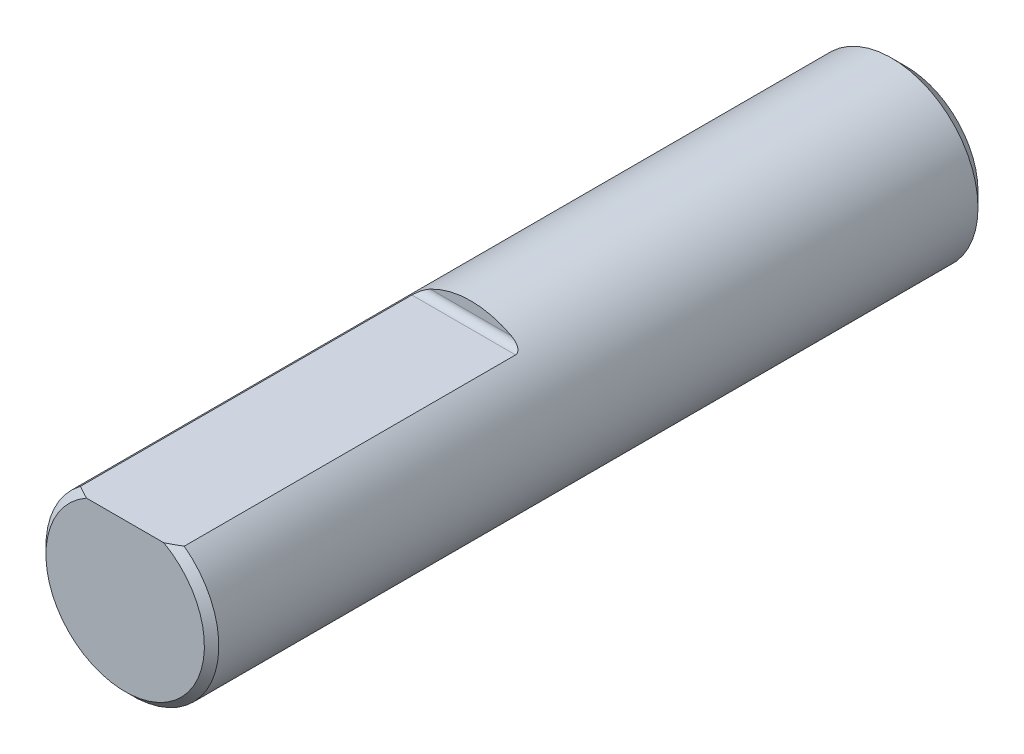
ISO-10303-21;
HEADER;
FILE_DESCRIPTION(('STEP AP214'),'2;1');
FILE_NAME('part.step','',(''),(''),'','','');
FILE_SCHEMA(('AUTOMOTIVE_DESIGN { 1 0 10303 214 1 1 1 1 }'));
ENDSEC;
DATA;
#1=APPLICATION_CONTEXT('core data for automotive mechanical design processes');
#2=APPLICATION_PROTOCOL_DEFINITION('international standard','automotive_design',2000,#1);
#3=PRODUCT_CONTEXT('',#1,'mechanical');
#4=PRODUCT('Part','Part','',(#3));
#5=PRODUCT_RELATED_PRODUCT_CATEGORY('part','',(#4));
#6=PRODUCT_DEFINITION_FORMATION('','',#4);
#7=PRODUCT_DEFINITION_CONTEXT('part definition',#1,'design');
#8=PRODUCT_DEFINITION('design','',#6,#7);
#9=PRODUCT_DEFINITION_SHAPE('','',#8);
#10=(LENGTH_UNIT() NAMED_UNIT(*) SI_UNIT(.MILLI.,.METRE.));
#11=(NAMED_UNIT(*) PLANE_ANGLE_UNIT() SI_UNIT($,.RADIAN.));
#12=(NAMED_UNIT(*) SI_UNIT($,.STERADIAN.) SOLID_ANGLE_UNIT());
#13=UNCERTAINTY_MEASURE_WITH_UNIT(LENGTH_MEASURE(1.E-05),#10,'distance_accuracy_value','');
#14=(GEOMETRIC_REPRESENTATION_CONTEXT(3) GLOBAL_UNCERTAINTY_ASSIGNED_CONTEXT((#13)) GLOBAL_UNIT_ASSIGNED_CONTEXT((#10,
#11,#12)) REPRESENTATION_CONTEXT('',''));
#15=CARTESIAN_POINT('',(0.,0.,0.));
#16=DIRECTION('',(0.,0.,1.));
#17=DIRECTION('',(1.,0.,0.));
#18=AXIS2_PLACEMENT_3D('',#15,#16,#17);
#19=CARTESIAN_POINT('',(0.,0.,27.1));
#20=DIRECTION('',(0.,0.,-1.));
#21=DIRECTION('',(-1.,0.,0.));
#22=AXIS2_PLACEMENT_3D('',#19,#20,#21);
#23=CYLINDRICAL_SURFACE('',#22,3.);
#24=CARTESIAN_POINT('',(0.,0.,0.500000000000021));
#25=DIRECTION('',(0.,0.,1.));
#26=DIRECTION('',(1.,0.,0.));
#27=AXIS2_PLACEMENT_3D('',#24,#25,#26);
#28=CIRCLE('',#27,3.);
#29=CARTESIAN_POINT('',(3.,0.,0.500000000000021));
#30=VERTEX_POINT('',#29);
#31=EDGE_CURVE('E179',#30,#30,#28,.T.);
#32=ORIENTED_EDGE('',*,*,#31,.T.);
#33=EDGE_LOOP('',(#32));
#34=FACE_BOUND('',#33,.T.);
#35=CARTESIAN_POINT('',(0.,0.,15.1));
#36=DIRECTION('',(0.,0.,1.));
#37=DIRECTION('',(1.,0.,0.));
#38=AXIS2_PLACEMENT_3D('',#35,#36,#37);
#39=CIRCLE('',#38,3.);
#40=CARTESIAN_POINT('',(1.40623611104252,2.65,15.1));
#41=VERTEX_POINT('',#40);
#42=CARTESIAN_POINT('',(-1.40623611104252,2.65,15.1));
#43=VERTEX_POINT('',#42);
#44=EDGE_CURVE('E120',#41,#43,#39,.T.);
#45=ORIENTED_EDGE('',*,*,#44,.F.);
#46=CARTESIAN_POINT('',(1.40623611104252,2.65,15.1));
#47=CARTESIAN_POINT('',(1.42476719312358,2.64016820918073,15.1000086371319));
#48=CARTESIAN_POINT('',(1.44320541755287,2.63013300387646,15.1005812001906));
#49=CARTESIAN_POINT('',(1.47987326357008,2.609677203619,15.1030548188532));
#50=CARTESIAN_POINT('',(1.49810172472944,2.59925520129951,15.1049612940171));
#51=CARTESIAN_POINT('',(1.5343315751367,2.57803639991808,15.110329872664));
#52=CARTESIAN_POINT('',(1.55232959190176,2.567237122853,15.1138054139997));
#53=CARTESIAN_POINT('',(1.587744792987,2.54548552392082,15.1225921781681));
#54=CARTESIAN_POINT('',(1.60516300800453,2.53453352883204,15.1278999291877));
#55=CARTESIAN_POINT('',(1.63485119249192,2.51545006459067,15.1390846196437));
#56=CARTESIAN_POINT('',(1.64730062464286,2.50731204810866,15.1444706479159));
#57=CARTESIAN_POINT('',(1.67158745821928,2.49118591569291,15.1566602982219));
#58=CARTESIAN_POINT('',(1.68342527260069,2.48319770099929,15.1634629477389));
#59=CARTESIAN_POINT('',(1.7063536380022,2.46749911358801,15.178783929621));
#60=CARTESIAN_POINT('',(1.71743676342143,2.45979177514725,15.1873167211089));
#61=CARTESIAN_POINT('',(1.73834080545491,2.44506310531191,15.2063169358666));
#62=CARTESIAN_POINT('',(1.74816416885122,2.43804045064985,15.2167805095582));
#63=CARTESIAN_POINT('',(1.76296100156874,2.4273488297489,15.2359681663318));
#64=CARTESIAN_POINT('',(1.76845651552901,2.42334468487254,15.2440999651992));
#65=CARTESIAN_POINT('',(1.77837742284304,2.41607356683765,15.2613121283322));
#66=CARTESIAN_POINT('',(1.78280270247776,2.412806672019,15.2703925932529));
#67=CARTESIAN_POINT('',(1.79033772979604,2.40722107270283,15.2895122670731));
#68=CARTESIAN_POINT('',(1.79343027877899,2.40491477660354,15.2995620738033));
#69=CARTESIAN_POINT('',(1.79791719542313,2.40156245011977,15.3202177234302));
#70=CARTESIAN_POINT('',(1.79931806471234,2.40051159487049,15.3308212730418));
#71=CARTESIAN_POINT('',(1.79993609107004,2.40004787789945,15.3443119358684));
#72=CARTESIAN_POINT('',(1.80000125917157,2.39999896367675,15.3471567213289));
#73=CARTESIAN_POINT('',(1.8,2.4,15.35));
#74=B_SPLINE_CURVE_WITH_KNOTS('',3,(#46,#47,#48,#49,#50,#51,#52,#53,#54,#55,#56,#57,#58,#59,#60,
#61,#62,#63,#64,#65,#66,#67,#68,#69,#70,#71,#72,#73),.UNSPECIFIED.,.F.,.F.,(4,2,2,2,2,2,2,2,2,2,
2,2,2,4),(0.,0.0629448752516046,0.126146985991397,0.189900955592974,0.253534776403439,
0.300929708760606,0.348292210920324,0.396068177672549,0.443749898608375,0.475451559889888,
0.507156588191373,0.539259331957677,0.571238298604583,0.579771352693865),.UNSPECIFIED.);
#75=CARTESIAN_POINT('',(1.8,2.4,15.35));
#76=VERTEX_POINT('',#75);
#77=EDGE_CURVE('E52',#41,#76,#74,.T.);
#78=ORIENTED_EDGE('',*,*,#77,.T.);
#79=DIRECTION('',(0.,0.,1.));
#80=VECTOR('',#79,1.);
#81=CARTESIAN_POINT('',(1.8,2.4,15.1));
#82=LINE('',#81,#80);
#83=CARTESIAN_POINT('',(1.8,2.4,26.85));
#84=VERTEX_POINT('',#83);
#85=EDGE_CURVE('E126',#76,#84,#82,.T.);
#86=ORIENTED_EDGE('',*,*,#85,.T.);
#87=CARTESIAN_POINT('',(0.,0.,26.85));
#88=DIRECTION('',(0.,0.,1.));
#89=DIRECTION('',(1.,0.,0.));
#90=AXIS2_PLACEMENT_3D('',#87,#88,#89);
#91=CIRCLE('',#90,3.);
#92=CARTESIAN_POINT('',(-1.8,2.4,26.85));
#93=VERTEX_POINT('',#92);
#94=EDGE_CURVE('E181',#84,#93,#91,.F.);
#95=ORIENTED_EDGE('',*,*,#94,.T.);
#96=DIRECTION('',(0.,0.,1.));
#97=VECTOR('',#96,1.);
#98=CARTESIAN_POINT('',(-1.8,2.4,15.1));
#99=LINE('',#98,#97);
#100=CARTESIAN_POINT('',(-1.8,2.4,15.35));
#101=VERTEX_POINT('',#100);
#102=EDGE_CURVE('E123',#101,#93,#99,.T.);
#103=ORIENTED_EDGE('',*,*,#102,.F.);
#104=CARTESIAN_POINT('',(-1.8,2.4,15.35));
#105=CARTESIAN_POINT('',(-1.80002307596757,2.3999805782066,15.3398497762364));
#106=CARTESIAN_POINT('',(-1.79917762268597,2.40061688617292,15.3297358056779));
#107=CARTESIAN_POINT('',(-1.79595829572651,2.40302732127865,15.3100064136077));
#108=CARTESIAN_POINT('',(-1.79360165849544,2.4047886160273,15.3003866749197));
#109=CARTESIAN_POINT('',(-1.7875726833598,2.40927311413033,15.2818678747454));
#110=CARTESIAN_POINT('',(-1.78390570997181,2.41199239485877,15.272966053617));
#111=CARTESIAN_POINT('',(-1.77549784658827,2.41818838106542,15.255949471908));
#112=CARTESIAN_POINT('',(-1.77075379680029,2.42166731394476,15.2478371295));
#113=CARTESIAN_POINT('',(-1.75783211284051,2.43107324956358,15.2286061898585));
#114=CARTESIAN_POINT('',(-1.74912509698599,2.43735345452888,15.2180179864987));
#115=CARTESIAN_POINT('',(-1.73041079319432,2.45067580006142,15.1986445717313));
#116=CARTESIAN_POINT('',(-1.720401237775,2.45771926566297,15.1898625750475));
#117=CARTESIAN_POINT('',(-1.69291719447429,2.47678356115711,15.1688774643669));
#118=CARTESIAN_POINT('',(-1.67469673683116,2.48915658953795,15.157981015766));
#119=CARTESIAN_POINT('',(-1.63679129355607,2.51424696062243,15.139488799886));
#120=CARTESIAN_POINT('',(-1.61709867274992,2.52696584431851,15.1319118722863));
#121=CARTESIAN_POINT('',(-1.58162893424236,2.54927028707975,15.1209400595368));
#122=CARTESIAN_POINT('',(-1.56603616538931,2.55888071698269,15.1169789548098));
#123=CARTESIAN_POINT('',(-1.53445756909974,2.57794112174126,15.1103976350237));
#124=CARTESIAN_POINT('',(-1.51847138971993,2.58739093911798,15.107778669992));
#125=CARTESIAN_POINT('',(-1.48653771156903,2.60586627018725,15.1037481910994));
#126=CARTESIAN_POINT('',(-1.47059570505126,2.61489647961756,15.1023138133363));
#127=CARTESIAN_POINT('',(-1.4385387009133,2.63266838458361,15.1004432278105));
#128=CARTESIAN_POINT('',(-1.42242416370951,2.64141067387946,15.1000048201049));
#129=CARTESIAN_POINT('',(-1.40623611104252,2.65,15.1));
#130=B_SPLINE_CURVE_WITH_KNOTS('',3,(#104,#105,#106,#107,#108,#109,#110,#111,#112,#113,#114,
#115,#116,#117,#118,#119,#120,#121,#122,#123,#124,#125,#126,#127,#128,#129),.UNSPECIFIED.,.F.,
.F.,(4,2,2,2,2,2,2,2,2,2,2,2,4),(0.,0.0303382083179854,0.0603363917658789,0.0902131438331527,
0.120178703859017,0.165158889955237,0.210218452837776,0.283525899859539,0.357244171671546,
0.413407103500159,0.469622249114082,0.524725195147192,0.579706308511011),.UNSPECIFIED.);
#131=EDGE_CURVE('E11',#101,#43,#130,.T.);
#132=ORIENTED_EDGE('',*,*,#131,.T.);
#133=EDGE_LOOP('',(#45,#78,#86,#95,#103,#132));
#134=FACE_BOUND('',#133,.T.);
#135=ADVANCED_FACE('F38',(#34,#134),#23,.T.);
#136=CARTESIAN_POINT('',(0.,0.,27.1));
#137=DIRECTION('',(0.,0.,1.));
#138=DIRECTION('',(1.,0.,0.));
#139=AXIS2_PLACEMENT_3D('',#136,#137,#138);
#140=PLANE('',#139);
#141=DIRECTION('',(1.,0.,0.));
#142=VECTOR('',#141,1.);
#143=CARTESIAN_POINT('',(-1.8,2.4,27.1));
#144=LINE('',#143,#142);
#145=CARTESIAN_POINT('',(-1.34257215820978,2.4,27.1));
#146=VERTEX_POINT('',#145);
#147=CARTESIAN_POINT('',(1.34257215820978,2.4,27.1));
#148=VERTEX_POINT('',#147);
#149=EDGE_CURVE('E118',#146,#148,#144,.T.);
#150=ORIENTED_EDGE('',*,*,#149,.F.);
#151=CARTESIAN_POINT('',(0.,0.,27.1));
#152=DIRECTION('',(0.,0.,1.));
#153=DIRECTION('',(1.,0.,0.));
#154=AXIS2_PLACEMENT_3D('',#151,#152,#153);
#155=CIRCLE('',#154,2.75000000000001);
#156=EDGE_CURVE('E128',#146,#148,#155,.T.);
#157=ORIENTED_EDGE('',*,*,#156,.T.);
#158=EDGE_LOOP('',(#150,#157));
#159=FACE_BOUND('',#158,.T.);
#160=ADVANCED_FACE('F156',(#159),#140,.T.);
#161=CARTESIAN_POINT('',(0.,0.,0.));
#162=DIRECTION('',(0.,0.,1.));
#163=DIRECTION('',(1.,0.,0.));
#164=AXIS2_PLACEMENT_3D('',#161,#162,#163);
#165=PLANE('',#164);
#166=CARTESIAN_POINT('',(0.,0.,0.));
#167=DIRECTION('',(0.,0.,1.));
#168=DIRECTION('',(1.,0.,0.));
#169=AXIS2_PLACEMENT_3D('',#166,#167,#168);
#170=CIRCLE('',#169,2.49999999999998);
#171=CARTESIAN_POINT('',(2.49999999999998,0.,0.));
#172=VERTEX_POINT('',#171);
#173=EDGE_CURVE('E176',#172,#172,#170,.F.);
#174=ORIENTED_EDGE('',*,*,#173,.T.);
#175=EDGE_LOOP('',(#174));
#176=FACE_BOUND('',#175,.T.);
#177=DIRECTION('',(1.,0.,0.));
#178=VECTOR('',#177,1.);
#179=CARTESIAN_POINT('',(0.,0.75,0.));
#180=LINE('',#179,#178);
#181=CARTESIAN_POINT('',(-0.661437827766148,0.75,0.));
#182=VERTEX_POINT('',#181);
#183=CARTESIAN_POINT('',(0.661437827766148,0.75,0.));
#184=VERTEX_POINT('',#183);
#185=EDGE_CURVE('E113',#182,#184,#180,.T.);
#186=ORIENTED_EDGE('',*,*,#185,.F.);
#187=CARTESIAN_POINT('',(0.,0.,0.));
#188=DIRECTION('',(0.,0.,-1.));
#189=DIRECTION('',(-1.,0.,0.));
#190=AXIS2_PLACEMENT_3D('',#187,#188,#189);
#191=CIRCLE('',#190,1.);
#192=EDGE_CURVE('E101',#184,#182,#191,.T.);
#193=ORIENTED_EDGE('',*,*,#192,.F.);
#194=EDGE_LOOP('',(#186,#193));
#195=FACE_BOUND('',#194,.T.);
#196=ADVANCED_FACE('F154',(#176,#195),#165,.F.);
#197=CARTESIAN_POINT('',(-1.8,2.4,15.1));
#198=DIRECTION('',(0.,-1.,0.));
#199=DIRECTION('',(0.,0.,-1.));
#200=AXIS2_PLACEMENT_3D('',#197,#198,#199);
#201=PLANE('',#200);
#202=ORIENTED_EDGE('',*,*,#85,.F.);
#203=DIRECTION('',(1.,0.,0.));
#204=VECTOR('',#203,1.);
#205=CARTESIAN_POINT('',(-1.8,2.4,15.35));
#206=LINE('',#205,#204);
#207=EDGE_CURVE('E59',#76,#101,#206,.F.);
#208=ORIENTED_EDGE('',*,*,#207,.T.);
#209=ORIENTED_EDGE('',*,*,#102,.T.);
#210=CARTESIAN_POINT('',(-1.8,2.4,26.85));
#211=CARTESIAN_POINT('',(-1.76273123698928,2.4,26.8723595436047));
#212=CARTESIAN_POINT('',(-1.72526649526937,2.4,26.8943956211421));
#213=CARTESIAN_POINT('',(-1.64993454455618,2.4,26.9377272457753));
#214=CARTESIAN_POINT('',(-1.6120675295446,2.4,26.9590231303671));
#215=CARTESIAN_POINT('',(-1.53588371404093,2.4,27.0008029147796));
#216=CARTESIAN_POINT('',(-1.49756688517465,2.4,27.0212867630167));
#217=CARTESIAN_POINT('',(-1.42044115771704,2.4,27.0613498939592));
#218=CARTESIAN_POINT('',(-1.38163203974269,2.4,27.0809287539275));
#219=CARTESIAN_POINT('',(-1.34257215820978,2.4,27.1));
#220=B_SPLINE_CURVE_WITH_KNOTS('',3,(#210,#211,#212,#213,#214,#215,#216,#217,#218,#219),
.UNSPECIFIED.,.F.,.F.,(4,2,2,2,4),(0.,0.130385484602137,0.260710717625486,0.391044216193948,
0.521437993147202),.UNSPECIFIED.);
#221=EDGE_CURVE('E132',#93,#146,#220,.T.);
#222=ORIENTED_EDGE('',*,*,#221,.T.);
#223=ORIENTED_EDGE('',*,*,#149,.T.);
#224=CARTESIAN_POINT('',(1.34257215820978,2.4,27.1));
#225=CARTESIAN_POINT('',(1.38163203974269,2.4,27.0809287539275));
#226=CARTESIAN_POINT('',(1.42044115771705,2.4,27.0613498939592));
#227=CARTESIAN_POINT('',(1.49756688517465,2.4,27.0212867630167));
#228=CARTESIAN_POINT('',(1.53588371404093,2.4,27.0008029147796));
#229=CARTESIAN_POINT('',(1.6120675295446,2.4,26.9590231303671));
#230=CARTESIAN_POINT('',(1.64993454455618,2.4,26.9377272457753));
#231=CARTESIAN_POINT('',(1.72526649526937,2.4,26.8943956211421));
#232=CARTESIAN_POINT('',(1.76273123698928,2.4,26.8723595436047));
#233=CARTESIAN_POINT('',(1.8,2.4,26.85));
#234=B_SPLINE_CURVE_WITH_KNOTS('',3,(#224,#225,#226,#227,#228,#229,#230,#231,#232,#233),
.UNSPECIFIED.,.F.,.F.,(4,2,2,2,4),(0.,0.130393776953253,0.260727275521715,0.391052508545065,
0.521437993147201),.UNSPECIFIED.);
#235=EDGE_CURVE('E140',#148,#84,#234,.T.);
#236=ORIENTED_EDGE('',*,*,#235,.T.);
#237=EDGE_LOOP('',(#202,#208,#209,#222,#223,#236));
#238=FACE_BOUND('',#237,.T.);
#239=ADVANCED_FACE('F148',(#238),#201,.F.);
#240=CARTESIAN_POINT('',(0.,0.,15.1));
#241=DIRECTION('',(0.,0.,1.));
#242=DIRECTION('',(1.,0.,0.));
#243=AXIS2_PLACEMENT_3D('',#240,#241,#242);
#244=PLANE('',#243);
#245=ORIENTED_EDGE('',*,*,#44,.T.);
#246=DIRECTION('',(1.,0.,0.));
#247=VECTOR('',#246,1.);
#248=CARTESIAN_POINT('',(0.,2.65,15.1));
#249=LINE('',#248,#247);
#250=EDGE_CURVE('E173',#43,#41,#249,.T.);
#251=ORIENTED_EDGE('',*,*,#250,.T.);
#252=EDGE_LOOP('',(#245,#251));
#253=FACE_BOUND('',#252,.T.);
#254=ADVANCED_FACE('F153',(#253),#244,.T.);
#255=CARTESIAN_POINT('',(0.,0.,27.1));
#256=DIRECTION('',(0.,0.,-1.));
#257=DIRECTION('',(-1.,0.,0.));
#258=AXIS2_PLACEMENT_3D('',#255,#256,#257);
#259=CONICAL_SURFACE('',#258,2.75000000000001,0.785398163397451);
#260=ORIENTED_EDGE('',*,*,#221,.F.);
#261=ORIENTED_EDGE('',*,*,#94,.F.);
#262=ORIENTED_EDGE('',*,*,#235,.F.);
#263=ORIENTED_EDGE('',*,*,#156,.F.);
#264=EDGE_LOOP('',(#260,#261,#262,#263));
#265=FACE_BOUND('',#264,.T.);
#266=ADVANCED_FACE('F146',(#265),#259,.T.);
#267=CARTESIAN_POINT('',(0.,0.,2.5));
#268=DIRECTION('',(0.,0.,-1.));
#269=DIRECTION('',(-1.,0.,0.));
#270=AXIS2_PLACEMENT_3D('',#267,#268,#269);
#271=CYLINDRICAL_SURFACE('',#270,1.);
#272=ORIENTED_EDGE('',*,*,#192,.T.);
#273=DIRECTION('',(0.,0.,-1.));
#274=VECTOR('',#273,1.);
#275=CARTESIAN_POINT('',(-0.661437827766148,0.75,2.5));
#276=LINE('',#275,#274);
#277=CARTESIAN_POINT('',(-0.661437827766148,0.75,2.5));
#278=VERTEX_POINT('',#277);
#279=EDGE_CURVE('E95',#278,#182,#276,.T.);
#280=ORIENTED_EDGE('',*,*,#279,.F.);
#281=CARTESIAN_POINT('',(0.,0.,2.5));
#282=DIRECTION('',(0.,0.,-1.));
#283=DIRECTION('',(-1.,0.,0.));
#284=AXIS2_PLACEMENT_3D('',#281,#282,#283);
#285=CIRCLE('',#284,1.);
#286=CARTESIAN_POINT('',(0.661437827766148,0.75,2.5));
#287=VERTEX_POINT('',#286);
#288=EDGE_CURVE('E99',#287,#278,#285,.T.);
#289=ORIENTED_EDGE('',*,*,#288,.F.);
#290=DIRECTION('',(0.,0.,-1.));
#291=VECTOR('',#290,1.);
#292=CARTESIAN_POINT('',(0.661437827766148,0.75,2.5));
#293=LINE('',#292,#291);
#294=EDGE_CURVE('E105',#287,#184,#293,.T.);
#295=ORIENTED_EDGE('',*,*,#294,.T.);
#296=EDGE_LOOP('',(#272,#280,#289,#295));
#297=FACE_BOUND('',#296,.T.);
#298=ADVANCED_FACE('F97',(#297),#271,.F.);
#299=CARTESIAN_POINT('',(0.,0.75,2.5));
#300=DIRECTION('',(0.,1.,0.));
#301=DIRECTION('',(0.,0.,1.));
#302=AXIS2_PLACEMENT_3D('',#299,#300,#301);
#303=PLANE('',#302);
#304=ORIENTED_EDGE('',*,*,#185,.T.);
#305=ORIENTED_EDGE('',*,*,#294,.F.);
#306=DIRECTION('',(1.,0.,0.));
#307=VECTOR('',#306,1.);
#308=CARTESIAN_POINT('',(0.,0.75,2.5));
#309=LINE('',#308,#307);
#310=EDGE_CURVE('E106',#278,#287,#309,.T.);
#311=ORIENTED_EDGE('',*,*,#310,.F.);
#312=ORIENTED_EDGE('',*,*,#279,.T.);
#313=EDGE_LOOP('',(#304,#305,#311,#312));
#314=FACE_BOUND('',#313,.T.);
#315=ADVANCED_FACE('F109',(#314),#303,.F.);
#316=CARTESIAN_POINT('',(0.,0.,2.5));
#317=DIRECTION('',(0.,0.,-1.));
#318=DIRECTION('',(-1.,0.,0.));
#319=AXIS2_PLACEMENT_3D('',#316,#317,#318);
#320=PLANE('',#319);
#321=ORIENTED_EDGE('',*,*,#288,.T.);
#322=ORIENTED_EDGE('',*,*,#310,.T.);
#323=EDGE_LOOP('',(#321,#322));
#324=FACE_BOUND('',#323,.T.);
#325=ADVANCED_FACE('F112',(#324),#320,.T.);
#326=CARTESIAN_POINT('',(0.,0.,0.500000000000021));
#327=DIRECTION('',(0.,0.,1.));
#328=DIRECTION('',(1.,0.,0.));
#329=AXIS2_PLACEMENT_3D('',#326,#327,#328);
#330=CONICAL_SURFACE('',#329,3.,0.785398163397449);
#331=ORIENTED_EDGE('',*,*,#173,.F.);
#332=EDGE_LOOP('',(#331));
#333=FACE_BOUND('',#332,.T.);
#334=ORIENTED_EDGE('',*,*,#31,.F.);
#335=EDGE_LOOP('',(#334));
#336=FACE_BOUND('',#335,.T.);
#337=ADVANCED_FACE('F206',(#333,#336),#330,.T.);
#338=CARTESIAN_POINT('',(0.,2.65,15.35));
#339=DIRECTION('',(1.,0.,0.));
#340=DIRECTION('',(0.,0.,-1.));
#341=AXIS2_PLACEMENT_3D('',#338,#339,#340);
#342=CYLINDRICAL_SURFACE('',#341,0.25);
#343=ORIENTED_EDGE('',*,*,#131,.F.);
#344=ORIENTED_EDGE('',*,*,#207,.F.);
#345=ORIENTED_EDGE('',*,*,#77,.F.);
#346=ORIENTED_EDGE('',*,*,#250,.F.);
#347=EDGE_LOOP('',(#343,#344,#345,#346));
#348=FACE_BOUND('',#347,.T.);
#349=ADVANCED_FACE('F40',(#348),#342,.F.);
#350=CLOSED_SHELL('',(#135,#160,#196,#239,#254,#266,#298,#315,#325,#337,#349));
#351=MANIFOLD_SOLID_BREP('B2',#350);
#352=ADVANCED_BREP_SHAPE_REPRESENTATION('',(#18,#351),#14);
#353=SHAPE_DEFINITION_REPRESENTATION(#9,#352);
ENDSEC;
END-ISO-10303-21;
